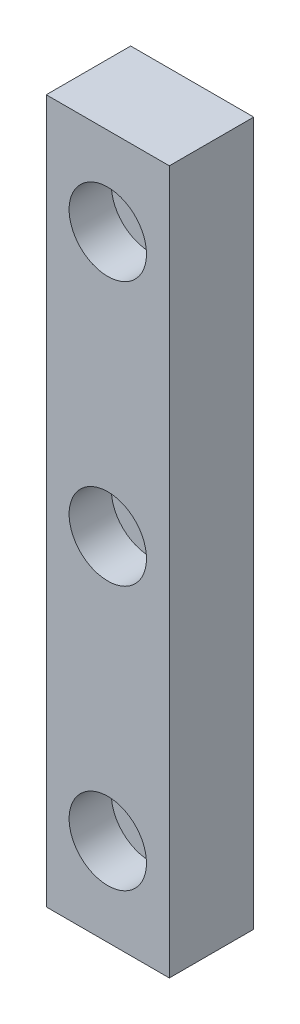
ISO-10303-21;
HEADER;
FILE_DESCRIPTION(('STEP AP214'),'2;1');
FILE_NAME('part.step','',(''),(''),'','','');
FILE_SCHEMA(('AUTOMOTIVE_DESIGN { 1 0 10303 214 1 1 1 1 }'));
ENDSEC;
DATA;
#1=APPLICATION_CONTEXT('core data for automotive mechanical design processes');
#2=APPLICATION_PROTOCOL_DEFINITION('international standard','automotive_design',2000,#1);
#3=PRODUCT_CONTEXT('',#1,'mechanical');
#4=PRODUCT('Part','Part','',(#3));
#5=PRODUCT_RELATED_PRODUCT_CATEGORY('part','',(#4));
#6=PRODUCT_DEFINITION_FORMATION('','',#4);
#7=PRODUCT_DEFINITION_CONTEXT('part definition',#1,'design');
#8=PRODUCT_DEFINITION('design','',#6,#7);
#9=PRODUCT_DEFINITION_SHAPE('','',#8);
#10=(LENGTH_UNIT() NAMED_UNIT(*) SI_UNIT(.MILLI.,.METRE.));
#11=(NAMED_UNIT(*) PLANE_ANGLE_UNIT() SI_UNIT($,.RADIAN.));
#12=(NAMED_UNIT(*) SI_UNIT($,.STERADIAN.) SOLID_ANGLE_UNIT());
#13=UNCERTAINTY_MEASURE_WITH_UNIT(LENGTH_MEASURE(1.E-05),#10,'distance_accuracy_value','');
#14=(GEOMETRIC_REPRESENTATION_CONTEXT(3) GLOBAL_UNCERTAINTY_ASSIGNED_CONTEXT((#13)) GLOBAL_UNIT_ASSIGNED_CONTEXT((#10,
#11,#12)) REPRESENTATION_CONTEXT('',''));
#15=CARTESIAN_POINT('',(0.,0.,0.));
#16=DIRECTION('',(0.,0.,1.));
#17=DIRECTION('',(1.,0.,0.));
#18=AXIS2_PLACEMENT_3D('',#15,#16,#17);
#19=CARTESIAN_POINT('',(0.,0.,4.8));
#20=DIRECTION('',(1.,0.,0.));
#21=DIRECTION('',(0.,1.,0.));
#22=AXIS2_PLACEMENT_3D('',#19,#20,#21);
#23=PLANE('',#22);
#24=DIRECTION('',(0.,-1.,0.));
#25=VECTOR('',#24,1.);
#26=CARTESIAN_POINT('',(0.,0.,0.));
#27=LINE('',#26,#25);
#28=CARTESIAN_POINT('',(0.,40.,0.));
#29=VERTEX_POINT('',#28);
#30=CARTESIAN_POINT('',(0.,0.,0.));
#31=VERTEX_POINT('',#30);
#32=EDGE_CURVE('E101',#29,#31,#27,.T.);
#33=ORIENTED_EDGE('',*,*,#32,.T.);
#34=DIRECTION('',(0.,0.,-1.));
#35=VECTOR('',#34,1.);
#36=CARTESIAN_POINT('',(0.,0.,4.8));
#37=LINE('',#36,#35);
#38=CARTESIAN_POINT('',(0.,0.,4.8));
#39=VERTEX_POINT('',#38);
#40=EDGE_CURVE('E11',#39,#31,#37,.T.);
#41=ORIENTED_EDGE('',*,*,#40,.F.);
#42=DIRECTION('',(0.,-1.,0.));
#43=VECTOR('',#42,1.);
#44=CARTESIAN_POINT('',(0.,0.,4.8));
#45=LINE('',#44,#43);
#46=CARTESIAN_POINT('',(0.,40.,4.8));
#47=VERTEX_POINT('',#46);
#48=EDGE_CURVE('E88',#47,#39,#45,.T.);
#49=ORIENTED_EDGE('',*,*,#48,.F.);
#50=DIRECTION('',(0.,0.,-1.));
#51=VECTOR('',#50,1.);
#52=CARTESIAN_POINT('',(0.,40.,4.8));
#53=LINE('',#52,#51);
#54=EDGE_CURVE('E97',#47,#29,#53,.T.);
#55=ORIENTED_EDGE('',*,*,#54,.T.);
#56=EDGE_LOOP('',(#33,#41,#49,#55));
#57=FACE_BOUND('',#56,.T.);
#58=ADVANCED_FACE('F35',(#57),#23,.F.);
#59=CARTESIAN_POINT('',(0.,0.,4.8));
#60=DIRECTION('',(0.,1.,0.));
#61=DIRECTION('',(0.,0.,1.));
#62=AXIS2_PLACEMENT_3D('',#59,#60,#61);
#63=PLANE('',#62);
#64=DIRECTION('',(1.,0.,0.));
#65=VECTOR('',#64,1.);
#66=CARTESIAN_POINT('',(0.,0.,0.));
#67=LINE('',#66,#65);
#68=CARTESIAN_POINT('',(7.,0.,0.));
#69=VERTEX_POINT('',#68);
#70=EDGE_CURVE('E92',#31,#69,#67,.T.);
#71=ORIENTED_EDGE('',*,*,#70,.T.);
#72=DIRECTION('',(0.,0.,-1.));
#73=VECTOR('',#72,1.);
#74=CARTESIAN_POINT('',(7.,0.,4.8));
#75=LINE('',#74,#73);
#76=CARTESIAN_POINT('',(7.,0.,4.8));
#77=VERTEX_POINT('',#76);
#78=EDGE_CURVE('E44',#77,#69,#75,.T.);
#79=ORIENTED_EDGE('',*,*,#78,.F.);
#80=DIRECTION('',(1.,0.,0.));
#81=VECTOR('',#80,1.);
#82=CARTESIAN_POINT('',(0.,0.,4.8));
#83=LINE('',#82,#81);
#84=EDGE_CURVE('E83',#39,#77,#83,.T.);
#85=ORIENTED_EDGE('',*,*,#84,.F.);
#86=ORIENTED_EDGE('',*,*,#40,.T.);
#87=EDGE_LOOP('',(#71,#79,#85,#86));
#88=FACE_BOUND('',#87,.T.);
#89=ADVANCED_FACE('F91',(#88),#63,.F.);
#90=CARTESIAN_POINT('',(7.,0.,4.8));
#91=DIRECTION('',(-1.,0.,0.));
#92=DIRECTION('',(0.,-1.,0.));
#93=AXIS2_PLACEMENT_3D('',#90,#91,#92);
#94=PLANE('',#93);
#95=DIRECTION('',(0.,1.,0.));
#96=VECTOR('',#95,1.);
#97=CARTESIAN_POINT('',(7.,0.,0.));
#98=LINE('',#97,#96);
#99=CARTESIAN_POINT('',(6.99999999999999,40.,0.));
#100=VERTEX_POINT('',#99);
#101=EDGE_CURVE('E70',#69,#100,#98,.T.);
#102=ORIENTED_EDGE('',*,*,#101,.T.);
#103=DIRECTION('',(0.,0.,-1.));
#104=VECTOR('',#103,1.);
#105=CARTESIAN_POINT('',(6.99999999999999,40.,4.8));
#106=LINE('',#105,#104);
#107=CARTESIAN_POINT('',(6.99999999999999,40.,4.8));
#108=VERTEX_POINT('',#107);
#109=EDGE_CURVE('E93',#108,#100,#106,.T.);
#110=ORIENTED_EDGE('',*,*,#109,.F.);
#111=DIRECTION('',(0.,1.,0.));
#112=VECTOR('',#111,1.);
#113=CARTESIAN_POINT('',(7.,0.,4.8));
#114=LINE('',#113,#112);
#115=EDGE_CURVE('E86',#77,#108,#114,.T.);
#116=ORIENTED_EDGE('',*,*,#115,.F.);
#117=ORIENTED_EDGE('',*,*,#78,.T.);
#118=EDGE_LOOP('',(#102,#110,#116,#117));
#119=FACE_BOUND('',#118,.T.);
#120=ADVANCED_FACE('F95',(#119),#94,.F.);
#121=CARTESIAN_POINT('',(0.,40.,4.8));
#122=DIRECTION('',(0.,-1.,0.));
#123=DIRECTION('',(0.,0.,-1.));
#124=AXIS2_PLACEMENT_3D('',#121,#122,#123);
#125=PLANE('',#124);
#126=DIRECTION('',(-1.,0.,0.));
#127=VECTOR('',#126,1.);
#128=CARTESIAN_POINT('',(0.,40.,0.));
#129=LINE('',#128,#127);
#130=EDGE_CURVE('E76',#100,#29,#129,.T.);
#131=ORIENTED_EDGE('',*,*,#130,.T.);
#132=ORIENTED_EDGE('',*,*,#54,.F.);
#133=DIRECTION('',(-1.,0.,0.));
#134=VECTOR('',#133,1.);
#135=CARTESIAN_POINT('',(0.,40.,4.8));
#136=LINE('',#135,#134);
#137=EDGE_CURVE('E53',#108,#47,#136,.T.);
#138=ORIENTED_EDGE('',*,*,#137,.F.);
#139=ORIENTED_EDGE('',*,*,#109,.T.);
#140=EDGE_LOOP('',(#131,#132,#138,#139));
#141=FACE_BOUND('',#140,.T.);
#142=ADVANCED_FACE('F153',(#141),#125,.F.);
#143=CARTESIAN_POINT('',(0.,0.,4.8));
#144=DIRECTION('',(0.,0.,-1.));
#145=DIRECTION('',(-1.,0.,0.));
#146=AXIS2_PLACEMENT_3D('',#143,#144,#145);
#147=PLANE('',#146);
#148=CARTESIAN_POINT('',(3.5,35.,4.8));
#149=DIRECTION('',(0.,0.,1.));
#150=DIRECTION('',(1.,0.,0.));
#151=AXIS2_PLACEMENT_3D('',#148,#149,#150);
#152=CIRCLE('',#151,2.2);
#153=CARTESIAN_POINT('',(5.7,35.,4.8));
#154=VERTEX_POINT('',#153);
#155=EDGE_CURVE('E280',#154,#154,#152,.T.);
#156=ORIENTED_EDGE('',*,*,#155,.F.);
#157=EDGE_LOOP('',(#156));
#158=FACE_BOUND('',#157,.T.);
#159=CARTESIAN_POINT('',(3.5,20.,4.8));
#160=DIRECTION('',(0.,0.,1.));
#161=DIRECTION('',(1.,0.,0.));
#162=AXIS2_PLACEMENT_3D('',#159,#160,#161);
#163=CIRCLE('',#162,2.2);
#164=CARTESIAN_POINT('',(5.7,20.,4.8));
#165=VERTEX_POINT('',#164);
#166=EDGE_CURVE('E127',#165,#165,#163,.T.);
#167=ORIENTED_EDGE('',*,*,#166,.F.);
#168=EDGE_LOOP('',(#167));
#169=FACE_BOUND('',#168,.T.);
#170=CARTESIAN_POINT('',(3.5,5.,4.8));
#171=DIRECTION('',(0.,0.,1.));
#172=DIRECTION('',(1.,0.,0.));
#173=AXIS2_PLACEMENT_3D('',#170,#171,#172);
#174=CIRCLE('',#173,2.2);
#175=CARTESIAN_POINT('',(5.7,5.,4.8));
#176=VERTEX_POINT('',#175);
#177=EDGE_CURVE('E114',#176,#176,#174,.T.);
#178=ORIENTED_EDGE('',*,*,#177,.F.);
#179=EDGE_LOOP('',(#178));
#180=FACE_BOUND('',#179,.T.);
#181=ORIENTED_EDGE('',*,*,#48,.T.);
#182=ORIENTED_EDGE('',*,*,#84,.T.);
#183=ORIENTED_EDGE('',*,*,#115,.T.);
#184=ORIENTED_EDGE('',*,*,#137,.T.);
#185=EDGE_LOOP('',(#181,#182,#183,#184));
#186=FACE_BOUND('',#185,.T.);
#187=ADVANCED_FACE('F84',(#158,#169,#180,#186),#147,.F.);
#188=CARTESIAN_POINT('',(0.,0.,0.));
#189=DIRECTION('',(0.,0.,-1.));
#190=DIRECTION('',(-1.,0.,0.));
#191=AXIS2_PLACEMENT_3D('',#188,#189,#190);
#192=PLANE('',#191);
#193=CARTESIAN_POINT('',(3.5,35.,0.));
#194=DIRECTION('',(0.,0.,-1.));
#195=DIRECTION('',(-1.,0.,0.));
#196=AXIS2_PLACEMENT_3D('',#193,#194,#195);
#197=CIRCLE('',#196,1.2);
#198=CARTESIAN_POINT('',(2.3,35.,0.));
#199=VERTEX_POINT('',#198);
#200=EDGE_CURVE('E38',#199,#199,#197,.T.);
#201=ORIENTED_EDGE('',*,*,#200,.F.);
#202=EDGE_LOOP('',(#201));
#203=FACE_BOUND('',#202,.T.);
#204=CARTESIAN_POINT('',(3.5,20.,0.));
#205=DIRECTION('',(0.,0.,-1.));
#206=DIRECTION('',(-1.,0.,0.));
#207=AXIS2_PLACEMENT_3D('',#204,#205,#206);
#208=CIRCLE('',#207,1.2);
#209=CARTESIAN_POINT('',(2.3,20.,0.));
#210=VERTEX_POINT('',#209);
#211=EDGE_CURVE('E112',#210,#210,#208,.T.);
#212=ORIENTED_EDGE('',*,*,#211,.F.);
#213=EDGE_LOOP('',(#212));
#214=FACE_BOUND('',#213,.T.);
#215=CARTESIAN_POINT('',(3.5,5.,0.));
#216=DIRECTION('',(0.,0.,-1.));
#217=DIRECTION('',(-1.,0.,0.));
#218=AXIS2_PLACEMENT_3D('',#215,#216,#217);
#219=CIRCLE('',#218,1.2);
#220=CARTESIAN_POINT('',(2.3,5.,0.));
#221=VERTEX_POINT('',#220);
#222=EDGE_CURVE('E104',#221,#221,#219,.T.);
#223=ORIENTED_EDGE('',*,*,#222,.F.);
#224=EDGE_LOOP('',(#223));
#225=FACE_BOUND('',#224,.T.);
#226=ORIENTED_EDGE('',*,*,#32,.F.);
#227=ORIENTED_EDGE('',*,*,#130,.F.);
#228=ORIENTED_EDGE('',*,*,#101,.F.);
#229=ORIENTED_EDGE('',*,*,#70,.F.);
#230=EDGE_LOOP('',(#226,#227,#228,#229));
#231=FACE_BOUND('',#230,.T.);
#232=ADVANCED_FACE('F152',(#203,#214,#225,#231),#192,.T.);
#233=CARTESIAN_POINT('',(3.5,5.,4.8));
#234=DIRECTION('',(0.,0.,1.));
#235=DIRECTION('',(1.,0.,0.));
#236=AXIS2_PLACEMENT_3D('',#233,#234,#235);
#237=CYLINDRICAL_SURFACE('',#236,1.2);
#238=ORIENTED_EDGE('',*,*,#222,.T.);
#239=EDGE_LOOP('',(#238));
#240=FACE_BOUND('',#239,.T.);
#241=CARTESIAN_POINT('',(3.5,5.,2.4));
#242=DIRECTION('',(0.,0.,1.));
#243=DIRECTION('',(1.,0.,0.));
#244=AXIS2_PLACEMENT_3D('',#241,#242,#243);
#245=CIRCLE('',#244,1.2);
#246=CARTESIAN_POINT('',(4.7,5.,2.4));
#247=VERTEX_POINT('',#246);
#248=EDGE_CURVE('E111',#247,#247,#245,.T.);
#249=ORIENTED_EDGE('',*,*,#248,.T.);
#250=EDGE_LOOP('',(#249));
#251=FACE_BOUND('',#250,.T.);
#252=ADVANCED_FACE('F136',(#240,#251),#237,.F.);
#253=CARTESIAN_POINT('',(4.7,5.,2.4));
#254=DIRECTION('',(0.,0.,-1.));
#255=DIRECTION('',(-1.,0.,0.));
#256=AXIS2_PLACEMENT_3D('',#253,#254,#255);
#257=PLANE('',#256);
#258=ORIENTED_EDGE('',*,*,#248,.F.);
#259=EDGE_LOOP('',(#258));
#260=FACE_BOUND('',#259,.T.);
#261=CARTESIAN_POINT('',(3.5,5.,2.4));
#262=DIRECTION('',(0.,0.,1.));
#263=DIRECTION('',(1.,0.,0.));
#264=AXIS2_PLACEMENT_3D('',#261,#262,#263);
#265=CIRCLE('',#264,2.2);
#266=CARTESIAN_POINT('',(5.7,5.,2.4));
#267=VERTEX_POINT('',#266);
#268=EDGE_CURVE('E119',#267,#267,#265,.T.);
#269=ORIENTED_EDGE('',*,*,#268,.T.);
#270=EDGE_LOOP('',(#269));
#271=FACE_BOUND('',#270,.T.);
#272=ADVANCED_FACE('F138',(#260,#271),#257,.F.);
#273=CARTESIAN_POINT('',(3.5,5.,4.8));
#274=DIRECTION('',(0.,0.,1.));
#275=DIRECTION('',(1.,0.,0.));
#276=AXIS2_PLACEMENT_3D('',#273,#274,#275);
#277=CYLINDRICAL_SURFACE('',#276,2.2);
#278=ORIENTED_EDGE('',*,*,#268,.F.);
#279=EDGE_LOOP('',(#278));
#280=FACE_BOUND('',#279,.T.);
#281=ORIENTED_EDGE('',*,*,#177,.T.);
#282=EDGE_LOOP('',(#281));
#283=FACE_BOUND('',#282,.T.);
#284=ADVANCED_FACE('F141',(#280,#283),#277,.F.);
#285=CARTESIAN_POINT('',(3.5,20.,4.8));
#286=DIRECTION('',(0.,0.,1.));
#287=DIRECTION('',(1.,0.,0.));
#288=AXIS2_PLACEMENT_3D('',#285,#286,#287);
#289=CYLINDRICAL_SURFACE('',#288,1.2);
#290=ORIENTED_EDGE('',*,*,#211,.T.);
#291=EDGE_LOOP('',(#290));
#292=FACE_BOUND('',#291,.T.);
#293=CARTESIAN_POINT('',(3.5,20.,2.4));
#294=DIRECTION('',(0.,0.,1.));
#295=DIRECTION('',(1.,0.,0.));
#296=AXIS2_PLACEMENT_3D('',#293,#294,#295);
#297=CIRCLE('',#296,1.2);
#298=CARTESIAN_POINT('',(4.7,20.,2.4));
#299=VERTEX_POINT('',#298);
#300=EDGE_CURVE('E115',#299,#299,#297,.T.);
#301=ORIENTED_EDGE('',*,*,#300,.T.);
#302=EDGE_LOOP('',(#301));
#303=FACE_BOUND('',#302,.T.);
#304=ADVANCED_FACE('F147',(#292,#303),#289,.F.);
#305=CARTESIAN_POINT('',(4.7,20.,2.4));
#306=DIRECTION('',(0.,0.,-1.));
#307=DIRECTION('',(-1.,0.,0.));
#308=AXIS2_PLACEMENT_3D('',#305,#306,#307);
#309=PLANE('',#308);
#310=ORIENTED_EDGE('',*,*,#300,.F.);
#311=EDGE_LOOP('',(#310));
#312=FACE_BOUND('',#311,.T.);
#313=CARTESIAN_POINT('',(3.5,20.,2.4));
#314=DIRECTION('',(0.,0.,1.));
#315=DIRECTION('',(1.,0.,0.));
#316=AXIS2_PLACEMENT_3D('',#313,#314,#315);
#317=CIRCLE('',#316,2.2);
#318=CARTESIAN_POINT('',(5.7,20.,2.4));
#319=VERTEX_POINT('',#318);
#320=EDGE_CURVE('E122',#319,#319,#317,.T.);
#321=ORIENTED_EDGE('',*,*,#320,.T.);
#322=EDGE_LOOP('',(#321));
#323=FACE_BOUND('',#322,.T.);
#324=ADVANCED_FACE('F222',(#312,#323),#309,.F.);
#325=CARTESIAN_POINT('',(3.5,20.,4.8));
#326=DIRECTION('',(0.,0.,1.));
#327=DIRECTION('',(1.,0.,0.));
#328=AXIS2_PLACEMENT_3D('',#325,#326,#327);
#329=CYLINDRICAL_SURFACE('',#328,2.2);
#330=ORIENTED_EDGE('',*,*,#320,.F.);
#331=EDGE_LOOP('',(#330));
#332=FACE_BOUND('',#331,.T.);
#333=ORIENTED_EDGE('',*,*,#166,.T.);
#334=EDGE_LOOP('',(#333));
#335=FACE_BOUND('',#334,.T.);
#336=ADVANCED_FACE('F231',(#332,#335),#329,.F.);
#337=CARTESIAN_POINT('',(3.5,35.,4.8));
#338=DIRECTION('',(0.,0.,1.));
#339=DIRECTION('',(1.,0.,0.));
#340=AXIS2_PLACEMENT_3D('',#337,#338,#339);
#341=CYLINDRICAL_SURFACE('',#340,1.2);
#342=ORIENTED_EDGE('',*,*,#200,.T.);
#343=EDGE_LOOP('',(#342));
#344=FACE_BOUND('',#343,.T.);
#345=CARTESIAN_POINT('',(3.5,35.,2.4));
#346=DIRECTION('',(0.,0.,1.));
#347=DIRECTION('',(1.,0.,0.));
#348=AXIS2_PLACEMENT_3D('',#345,#346,#347);
#349=CIRCLE('',#348,1.2);
#350=CARTESIAN_POINT('',(4.7,35.,2.4));
#351=VERTEX_POINT('',#350);
#352=EDGE_CURVE('E282',#351,#351,#349,.T.);
#353=ORIENTED_EDGE('',*,*,#352,.T.);
#354=EDGE_LOOP('',(#353));
#355=FACE_BOUND('',#354,.T.);
#356=ADVANCED_FACE('F241',(#344,#355),#341,.F.);
#357=CARTESIAN_POINT('',(4.7,35.,2.4));
#358=DIRECTION('',(0.,0.,-1.));
#359=DIRECTION('',(-1.,0.,0.));
#360=AXIS2_PLACEMENT_3D('',#357,#358,#359);
#361=PLANE('',#360);
#362=ORIENTED_EDGE('',*,*,#352,.F.);
#363=EDGE_LOOP('',(#362));
#364=FACE_BOUND('',#363,.T.);
#365=CARTESIAN_POINT('',(3.5,35.,2.4));
#366=DIRECTION('',(0.,0.,1.));
#367=DIRECTION('',(1.,0.,0.));
#368=AXIS2_PLACEMENT_3D('',#365,#366,#367);
#369=CIRCLE('',#368,2.2);
#370=CARTESIAN_POINT('',(5.7,35.,2.4));
#371=VERTEX_POINT('',#370);
#372=EDGE_CURVE('E278',#371,#371,#369,.T.);
#373=ORIENTED_EDGE('',*,*,#372,.T.);
#374=EDGE_LOOP('',(#373));
#375=FACE_BOUND('',#374,.T.);
#376=ADVANCED_FACE('F251',(#364,#375),#361,.F.);
#377=CARTESIAN_POINT('',(3.5,35.,4.8));
#378=DIRECTION('',(0.,0.,1.));
#379=DIRECTION('',(1.,0.,0.));
#380=AXIS2_PLACEMENT_3D('',#377,#378,#379);
#381=CYLINDRICAL_SURFACE('',#380,2.2);
#382=ORIENTED_EDGE('',*,*,#372,.F.);
#383=EDGE_LOOP('',(#382));
#384=FACE_BOUND('',#383,.T.);
#385=ORIENTED_EDGE('',*,*,#155,.T.);
#386=EDGE_LOOP('',(#385));
#387=FACE_BOUND('',#386,.T.);
#388=ADVANCED_FACE('F261',(#384,#387),#381,.F.);
#389=CLOSED_SHELL('',(#58,#89,#120,#142,#187,#232,#252,#272,#284,#304,#324,#336,#356,#376,#388));
#390=MANIFOLD_SOLID_BREP('B2',#389);
#391=ADVANCED_BREP_SHAPE_REPRESENTATION('',(#18,#390),#14);
#392=SHAPE_DEFINITION_REPRESENTATION(#9,#391);
ENDSEC;
END-ISO-10303-21;
